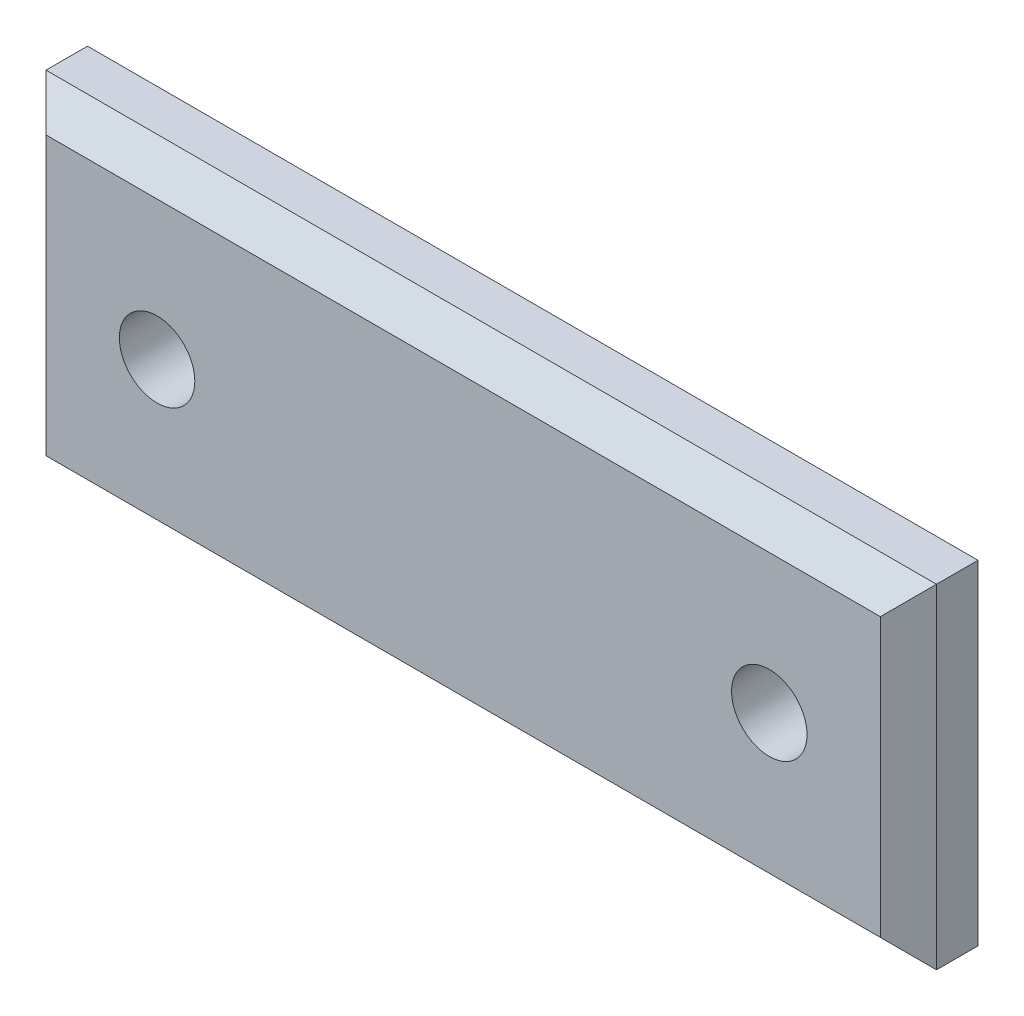
ISO-10303-21;
HEADER;
FILE_DESCRIPTION(('STEP AP214'),'2;1');
FILE_NAME('part.step','',(''),(''),'','','');
FILE_SCHEMA(('AUTOMOTIVE_DESIGN { 1 0 10303 214 1 1 1 1 }'));
ENDSEC;
DATA;
#1=APPLICATION_CONTEXT('core data for automotive mechanical design processes');
#2=APPLICATION_PROTOCOL_DEFINITION('international standard','automotive_design',2000,#1);
#3=PRODUCT_CONTEXT('',#1,'mechanical');
#4=PRODUCT('Part','Part','',(#3));
#5=PRODUCT_RELATED_PRODUCT_CATEGORY('part','',(#4));
#6=PRODUCT_DEFINITION_FORMATION('','',#4);
#7=PRODUCT_DEFINITION_CONTEXT('part definition',#1,'design');
#8=PRODUCT_DEFINITION('design','',#6,#7);
#9=PRODUCT_DEFINITION_SHAPE('','',#8);
#10=(LENGTH_UNIT() NAMED_UNIT(*) SI_UNIT(.MILLI.,.METRE.));
#11=(NAMED_UNIT(*) PLANE_ANGLE_UNIT() SI_UNIT($,.RADIAN.));
#12=(NAMED_UNIT(*) SI_UNIT($,.STERADIAN.) SOLID_ANGLE_UNIT());
#13=UNCERTAINTY_MEASURE_WITH_UNIT(LENGTH_MEASURE(1.E-05),#10,'distance_accuracy_value','');
#14=(GEOMETRIC_REPRESENTATION_CONTEXT(3) GLOBAL_UNCERTAINTY_ASSIGNED_CONTEXT((#13)) GLOBAL_UNIT_ASSIGNED_CONTEXT((#10,
#11,#12)) REPRESENTATION_CONTEXT('',''));
#15=CARTESIAN_POINT('',(0.,0.,0.));
#16=DIRECTION('',(0.,0.,1.));
#17=DIRECTION('',(1.,0.,0.));
#18=AXIS2_PLACEMENT_3D('',#15,#16,#17);
#19=CARTESIAN_POINT('',(25.4,-9.525,3.96875));
#20=DIRECTION('',(-1.,0.,0.));
#21=DIRECTION('',(0.,0.,1.));
#22=AXIS2_PLACEMENT_3D('',#19,#20,#21);
#23=PLANE('',#22);
#24=DIRECTION('',(0.,0.,-1.));
#25=VECTOR('',#24,1.);
#26=CARTESIAN_POINT('',(25.4,9.525,3.96875));
#27=LINE('',#26,#25);
#28=CARTESIAN_POINT('',(25.4,9.525,2.36855));
#29=VERTEX_POINT('',#28);
#30=CARTESIAN_POINT('',(25.4,9.525,0.));
#31=VERTEX_POINT('',#30);
#32=EDGE_CURVE('E87',#29,#31,#27,.T.);
#33=ORIENTED_EDGE('',*,*,#32,.F.);
#34=DIRECTION('',(0.,-1.,0.));
#35=VECTOR('',#34,1.);
#36=CARTESIAN_POINT('',(25.4,-9.525,2.36855));
#37=LINE('',#36,#35);
#38=CARTESIAN_POINT('',(25.4,-9.525,2.36855));
#39=VERTEX_POINT('',#38);
#40=EDGE_CURVE('E134',#29,#39,#37,.T.);
#41=ORIENTED_EDGE('',*,*,#40,.T.);
#42=DIRECTION('',(0.,0.,-1.));
#43=VECTOR('',#42,1.);
#44=CARTESIAN_POINT('',(25.4,-9.525,3.96875));
#45=LINE('',#44,#43);
#46=CARTESIAN_POINT('',(25.4,-9.525,0.));
#47=VERTEX_POINT('',#46);
#48=EDGE_CURVE('E107',#39,#47,#45,.T.);
#49=ORIENTED_EDGE('',*,*,#48,.T.);
#50=DIRECTION('',(0.,1.,0.));
#51=VECTOR('',#50,1.);
#52=CARTESIAN_POINT('',(25.4,-9.525,0.));
#53=LINE('',#52,#51);
#54=EDGE_CURVE('E102',#47,#31,#53,.T.);
#55=ORIENTED_EDGE('',*,*,#54,.T.);
#56=EDGE_LOOP('',(#33,#41,#49,#55));
#57=FACE_BOUND('',#56,.T.);
#58=ADVANCED_FACE('F36',(#57),#23,.F.);
#59=CARTESIAN_POINT('',(-25.4,9.525,3.96875));
#60=DIRECTION('',(0.,-1.,0.));
#61=DIRECTION('',(0.,0.,-1.));
#62=AXIS2_PLACEMENT_3D('',#59,#60,#61);
#63=PLANE('',#62);
#64=DIRECTION('',(0.,0.,-1.));
#65=VECTOR('',#64,1.);
#66=CARTESIAN_POINT('',(-25.4,9.525,3.96875));
#67=LINE('',#66,#65);
#68=CARTESIAN_POINT('',(-25.4,9.525,2.36855));
#69=VERTEX_POINT('',#68);
#70=CARTESIAN_POINT('',(-25.4,9.525,0.));
#71=VERTEX_POINT('',#70);
#72=EDGE_CURVE('E96',#69,#71,#67,.T.);
#73=ORIENTED_EDGE('',*,*,#72,.F.);
#74=DIRECTION('',(1.,0.,0.));
#75=VECTOR('',#74,1.);
#76=CARTESIAN_POINT('',(-25.4,9.525,2.36855));
#77=LINE('',#76,#75);
#78=EDGE_CURVE('E45',#69,#29,#77,.T.);
#79=ORIENTED_EDGE('',*,*,#78,.T.);
#80=ORIENTED_EDGE('',*,*,#32,.T.);
#81=DIRECTION('',(-1.,0.,0.));
#82=VECTOR('',#81,1.);
#83=CARTESIAN_POINT('',(-25.4,9.525,0.));
#84=LINE('',#83,#82);
#85=EDGE_CURVE('E90',#31,#71,#84,.T.);
#86=ORIENTED_EDGE('',*,*,#85,.T.);
#87=EDGE_LOOP('',(#73,#79,#80,#86));
#88=FACE_BOUND('',#87,.T.);
#89=ADVANCED_FACE('F89',(#88),#63,.F.);
#90=CARTESIAN_POINT('',(-25.4,-9.525,3.96875));
#91=DIRECTION('',(1.,0.,0.));
#92=DIRECTION('',(0.,0.,-1.));
#93=AXIS2_PLACEMENT_3D('',#90,#91,#92);
#94=PLANE('',#93);
#95=DIRECTION('',(0.,0.,-1.));
#96=VECTOR('',#95,1.);
#97=CARTESIAN_POINT('',(-25.4,-9.525,3.96875));
#98=LINE('',#97,#96);
#99=CARTESIAN_POINT('',(-25.4,-9.525,2.36855));
#100=VERTEX_POINT('',#99);
#101=CARTESIAN_POINT('',(-25.4,-9.525,0.));
#102=VERTEX_POINT('',#101);
#103=EDGE_CURVE('E120',#100,#102,#98,.T.);
#104=ORIENTED_EDGE('',*,*,#103,.F.);
#105=DIRECTION('',(0.,1.,0.));
#106=VECTOR('',#105,1.);
#107=CARTESIAN_POINT('',(-25.4,-9.525,2.36855));
#108=LINE('',#107,#106);
#109=EDGE_CURVE('E11',#100,#69,#108,.T.);
#110=ORIENTED_EDGE('',*,*,#109,.T.);
#111=ORIENTED_EDGE('',*,*,#72,.T.);
#112=DIRECTION('',(0.,-1.,0.));
#113=VECTOR('',#112,1.);
#114=CARTESIAN_POINT('',(-25.4,-9.525,0.));
#115=LINE('',#114,#113);
#116=EDGE_CURVE('E104',#71,#102,#115,.T.);
#117=ORIENTED_EDGE('',*,*,#116,.T.);
#118=EDGE_LOOP('',(#104,#110,#111,#117));
#119=FACE_BOUND('',#118,.T.);
#120=ADVANCED_FACE('F173',(#119),#94,.F.);
#121=CARTESIAN_POINT('',(-25.4,-9.525,3.96875));
#122=DIRECTION('',(0.,1.,0.));
#123=DIRECTION('',(0.,0.,1.));
#124=AXIS2_PLACEMENT_3D('',#121,#122,#123);
#125=PLANE('',#124);
#126=ORIENTED_EDGE('',*,*,#48,.F.);
#127=DIRECTION('',(-1.,0.,0.));
#128=VECTOR('',#127,1.);
#129=CARTESIAN_POINT('',(-25.4,-9.525,2.36855));
#130=LINE('',#129,#128);
#131=EDGE_CURVE('E131',#39,#100,#130,.T.);
#132=ORIENTED_EDGE('',*,*,#131,.T.);
#133=ORIENTED_EDGE('',*,*,#103,.T.);
#134=DIRECTION('',(1.,0.,0.));
#135=VECTOR('',#134,1.);
#136=CARTESIAN_POINT('',(-25.4,-9.525,0.));
#137=LINE('',#136,#135);
#138=EDGE_CURVE('E117',#102,#47,#137,.T.);
#139=ORIENTED_EDGE('',*,*,#138,.T.);
#140=EDGE_LOOP('',(#126,#132,#133,#139));
#141=FACE_BOUND('',#140,.T.);
#142=ADVANCED_FACE('F164',(#141),#125,.F.);
#143=CARTESIAN_POINT('',(0.,0.,3.96875));
#144=DIRECTION('',(0.,0.,-1.));
#145=DIRECTION('',(-1.,0.,0.));
#146=AXIS2_PLACEMENT_3D('',#143,#144,#145);
#147=PLANE('',#146);
#148=DIRECTION('',(0.,-1.,0.));
#149=VECTOR('',#148,1.);
#150=CARTESIAN_POINT('',(-23.7998,0.,3.96875));
#151=LINE('',#150,#149);
#152=CARTESIAN_POINT('',(-23.7998,7.9248,3.96875));
#153=VERTEX_POINT('',#152);
#154=CARTESIAN_POINT('',(-23.7998,-7.9248,3.96875));
#155=VERTEX_POINT('',#154);
#156=EDGE_CURVE('E95',#153,#155,#151,.T.);
#157=ORIENTED_EDGE('',*,*,#156,.T.);
#158=DIRECTION('',(1.,0.,0.));
#159=VECTOR('',#158,1.);
#160=CARTESIAN_POINT('',(0.,-7.9248,3.96875));
#161=LINE('',#160,#159);
#162=CARTESIAN_POINT('',(23.7998,-7.9248,3.96875));
#163=VERTEX_POINT('',#162);
#164=EDGE_CURVE('E128',#155,#163,#161,.T.);
#165=ORIENTED_EDGE('',*,*,#164,.T.);
#166=DIRECTION('',(0.,1.,0.));
#167=VECTOR('',#166,1.);
#168=CARTESIAN_POINT('',(23.7998,0.,3.96875));
#169=LINE('',#168,#167);
#170=CARTESIAN_POINT('',(23.7998,7.9248,3.96875));
#171=VERTEX_POINT('',#170);
#172=EDGE_CURVE('E126',#163,#171,#169,.T.);
#173=ORIENTED_EDGE('',*,*,#172,.T.);
#174=DIRECTION('',(-1.,0.,0.));
#175=VECTOR('',#174,1.);
#176=CARTESIAN_POINT('',(0.,7.9248,3.96875));
#177=LINE('',#176,#175);
#178=EDGE_CURVE('E124',#171,#153,#177,.T.);
#179=ORIENTED_EDGE('',*,*,#178,.T.);
#180=EDGE_LOOP('',(#157,#165,#173,#179));
#181=FACE_BOUND('',#180,.T.);
#182=CARTESIAN_POINT('',(-17.4625,0.,3.96875));
#183=DIRECTION('',(0.,0.,1.));
#184=DIRECTION('',(1.,0.,0.));
#185=AXIS2_PLACEMENT_3D('',#182,#183,#184);
#186=CIRCLE('',#185,2.15265);
#187=CARTESIAN_POINT('',(-15.30985,0.,3.96875));
#188=VERTEX_POINT('',#187);
#189=EDGE_CURVE('E146',#188,#188,#186,.T.);
#190=ORIENTED_EDGE('',*,*,#189,.F.);
#191=EDGE_LOOP('',(#190));
#192=FACE_BOUND('',#191,.T.);
#193=CARTESIAN_POINT('',(17.4625,0.,3.96875));
#194=DIRECTION('',(0.,0.,1.));
#195=DIRECTION('',(1.,0.,0.));
#196=AXIS2_PLACEMENT_3D('',#193,#194,#195);
#197=CIRCLE('',#196,2.15265);
#198=CARTESIAN_POINT('',(19.61515,0.,3.96875));
#199=VERTEX_POINT('',#198);
#200=EDGE_CURVE('E112',#199,#199,#197,.T.);
#201=ORIENTED_EDGE('',*,*,#200,.F.);
#202=EDGE_LOOP('',(#201));
#203=FACE_BOUND('',#202,.T.);
#204=ADVANCED_FACE('F162',(#181,#192,#203),#147,.F.);
#205=CARTESIAN_POINT('',(0.,0.,0.));
#206=DIRECTION('',(0.,0.,-1.));
#207=DIRECTION('',(-1.,0.,0.));
#208=AXIS2_PLACEMENT_3D('',#205,#206,#207);
#209=PLANE('',#208);
#210=CARTESIAN_POINT('',(-17.4625,0.,0.));
#211=DIRECTION('',(0.,0.,1.));
#212=DIRECTION('',(1.,0.,0.));
#213=AXIS2_PLACEMENT_3D('',#210,#211,#212);
#214=CIRCLE('',#213,2.15265);
#215=CARTESIAN_POINT('',(-15.30985,0.,0.));
#216=VERTEX_POINT('',#215);
#217=EDGE_CURVE('E151',#216,#216,#214,.T.);
#218=ORIENTED_EDGE('',*,*,#217,.T.);
#219=EDGE_LOOP('',(#218));
#220=FACE_BOUND('',#219,.T.);
#221=CARTESIAN_POINT('',(17.4625,0.,0.));
#222=DIRECTION('',(0.,0.,1.));
#223=DIRECTION('',(1.,0.,0.));
#224=AXIS2_PLACEMENT_3D('',#221,#222,#223);
#225=CIRCLE('',#224,2.15265);
#226=CARTESIAN_POINT('',(19.61515,0.,0.));
#227=VERTEX_POINT('',#226);
#228=EDGE_CURVE('E109',#227,#227,#225,.T.);
#229=ORIENTED_EDGE('',*,*,#228,.T.);
#230=EDGE_LOOP('',(#229));
#231=FACE_BOUND('',#230,.T.);
#232=ORIENTED_EDGE('',*,*,#54,.F.);
#233=ORIENTED_EDGE('',*,*,#138,.F.);
#234=ORIENTED_EDGE('',*,*,#116,.F.);
#235=ORIENTED_EDGE('',*,*,#85,.F.);
#236=EDGE_LOOP('',(#232,#233,#234,#235));
#237=FACE_BOUND('',#236,.T.);
#238=ADVANCED_FACE('F100',(#220,#231,#237),#209,.T.);
#239=CARTESIAN_POINT('',(17.4625,0.,3.96875));
#240=DIRECTION('',(0.,0.,1.));
#241=DIRECTION('',(1.,0.,0.));
#242=AXIS2_PLACEMENT_3D('',#239,#240,#241);
#243=CYLINDRICAL_SURFACE('',#242,2.15265);
#244=ORIENTED_EDGE('',*,*,#228,.F.);
#245=EDGE_LOOP('',(#244));
#246=FACE_BOUND('',#245,.T.);
#247=ORIENTED_EDGE('',*,*,#200,.T.);
#248=EDGE_LOOP('',(#247));
#249=FACE_BOUND('',#248,.T.);
#250=ADVANCED_FACE('F160',(#246,#249),#243,.F.);
#251=CARTESIAN_POINT('',(-17.4625,0.,3.96875));
#252=DIRECTION('',(0.,0.,1.));
#253=DIRECTION('',(1.,0.,0.));
#254=AXIS2_PLACEMENT_3D('',#251,#252,#253);
#255=CYLINDRICAL_SURFACE('',#254,2.15265);
#256=ORIENTED_EDGE('',*,*,#217,.F.);
#257=EDGE_LOOP('',(#256));
#258=FACE_BOUND('',#257,.T.);
#259=ORIENTED_EDGE('',*,*,#189,.T.);
#260=EDGE_LOOP('',(#259));
#261=FACE_BOUND('',#260,.T.);
#262=ADVANCED_FACE('F197',(#258,#261),#255,.F.);
#263=CARTESIAN_POINT('',(0.,7.9248,3.96875));
#264=DIRECTION('',(0.,-0.707106781186549,-0.707106781186546));
#265=DIRECTION('',(-1.,0.,0.));
#266=AXIS2_PLACEMENT_3D('',#263,#264,#265);
#267=PLANE('',#266);
#268=DIRECTION('',(0.577350269189625,0.577350269189625,-0.577350269189627));
#269=VECTOR('',#268,1.);
#270=CARTESIAN_POINT('',(15.8665333333334,-0.00846666666663894,11.9020166666667));
#271=LINE('',#270,#269);
#272=EDGE_CURVE('E140',#29,#171,#271,.F.);
#273=ORIENTED_EDGE('',*,*,#272,.F.);
#274=ORIENTED_EDGE('',*,*,#78,.F.);
#275=DIRECTION('',(-0.577350269189625,0.577350269189625,-0.577350269189627));
#276=VECTOR('',#275,1.);
#277=CARTESIAN_POINT('',(-21.1582,5.28320000000001,6.61035));
#278=LINE('',#277,#276);
#279=EDGE_CURVE('E40',#153,#69,#278,.T.);
#280=ORIENTED_EDGE('',*,*,#279,.F.);
#281=ORIENTED_EDGE('',*,*,#178,.F.);
#282=EDGE_LOOP('',(#273,#274,#280,#281));
#283=FACE_BOUND('',#282,.T.);
#284=ADVANCED_FACE('F38',(#283),#267,.F.);
#285=CARTESIAN_POINT('',(-23.7998,0.,3.96875));
#286=DIRECTION('',(0.707106781186549,0.,-0.707106781186546));
#287=DIRECTION('',(0.,-1.,0.));
#288=AXIS2_PLACEMENT_3D('',#285,#286,#287);
#289=PLANE('',#288);
#290=ORIENTED_EDGE('',*,*,#279,.T.);
#291=ORIENTED_EDGE('',*,*,#109,.F.);
#292=DIRECTION('',(0.577350269189625,0.577350269189625,0.577350269189627));
#293=VECTOR('',#292,1.);
#294=CARTESIAN_POINT('',(-21.1582,-5.28320000000001,6.61035));
#295=LINE('',#294,#293);
#296=EDGE_CURVE('E139',#155,#100,#295,.F.);
#297=ORIENTED_EDGE('',*,*,#296,.F.);
#298=ORIENTED_EDGE('',*,*,#156,.F.);
#299=EDGE_LOOP('',(#290,#291,#297,#298));
#300=FACE_BOUND('',#299,.T.);
#301=ADVANCED_FACE('F192',(#300),#289,.F.);
#302=CARTESIAN_POINT('',(23.7998,0.,3.96875));
#303=DIRECTION('',(-0.707106781186549,0.,-0.707106781186546));
#304=DIRECTION('',(0.,1.,0.));
#305=AXIS2_PLACEMENT_3D('',#302,#303,#304);
#306=PLANE('',#305);
#307=ORIENTED_EDGE('',*,*,#272,.T.);
#308=ORIENTED_EDGE('',*,*,#172,.F.);
#309=DIRECTION('',(0.577350269189625,-0.577350269189625,-0.577350269189627));
#310=VECTOR('',#309,1.);
#311=CARTESIAN_POINT('',(21.1582,-5.28320000000001,6.61035));
#312=LINE('',#311,#310);
#313=EDGE_CURVE('E137',#39,#163,#312,.F.);
#314=ORIENTED_EDGE('',*,*,#313,.F.);
#315=ORIENTED_EDGE('',*,*,#40,.F.);
#316=EDGE_LOOP('',(#307,#308,#314,#315));
#317=FACE_BOUND('',#316,.T.);
#318=ADVANCED_FACE('F189',(#317),#306,.F.);
#319=CARTESIAN_POINT('',(0.,-7.9248,3.96875));
#320=DIRECTION('',(0.,0.707106781186549,-0.707106781186546));
#321=DIRECTION('',(1.,0.,0.));
#322=AXIS2_PLACEMENT_3D('',#319,#320,#321);
#323=PLANE('',#322);
#324=ORIENTED_EDGE('',*,*,#296,.T.);
#325=ORIENTED_EDGE('',*,*,#131,.F.);
#326=ORIENTED_EDGE('',*,*,#313,.T.);
#327=ORIENTED_EDGE('',*,*,#164,.F.);
#328=EDGE_LOOP('',(#324,#325,#326,#327));
#329=FACE_BOUND('',#328,.T.);
#330=ADVANCED_FACE('F186',(#329),#323,.F.);
#331=CLOSED_SHELL('',(#58,#89,#120,#142,#204,#238,#250,#262,#284,#301,#318,#330));
#332=MANIFOLD_SOLID_BREP('B2',#331);
#333=ADVANCED_BREP_SHAPE_REPRESENTATION('',(#18,#332),#14);
#334=SHAPE_DEFINITION_REPRESENTATION(#9,#333);
ENDSEC;
END-ISO-10303-21;
